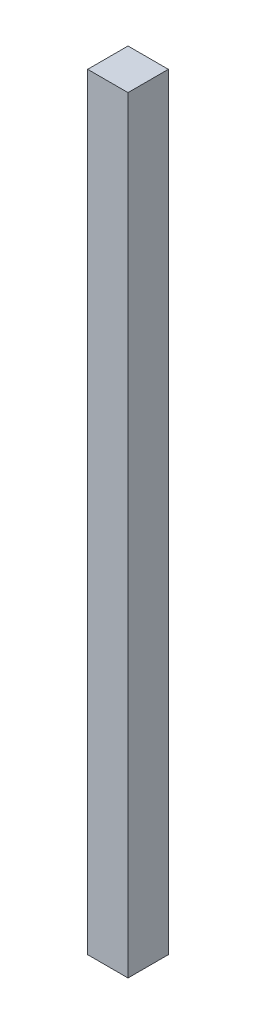
ISO-10303-21;
HEADER;
FILE_DESCRIPTION(('STEP AP214'),'2;1');
FILE_NAME('part.step','',(''),(''),'','','');
FILE_SCHEMA(('AUTOMOTIVE_DESIGN { 1 0 10303 214 1 1 1 1 }'));
ENDSEC;
DATA;
#1=APPLICATION_CONTEXT('core data for automotive mechanical design processes');
#2=APPLICATION_PROTOCOL_DEFINITION('international standard','automotive_design',2000,#1);
#3=PRODUCT_CONTEXT('',#1,'mechanical');
#4=PRODUCT('Part','Part','',(#3));
#5=PRODUCT_RELATED_PRODUCT_CATEGORY('part','',(#4));
#6=PRODUCT_DEFINITION_FORMATION('','',#4);
#7=PRODUCT_DEFINITION_CONTEXT('part definition',#1,'design');
#8=PRODUCT_DEFINITION('design','',#6,#7);
#9=PRODUCT_DEFINITION_SHAPE('','',#8);
#10=(LENGTH_UNIT() NAMED_UNIT(*) SI_UNIT(.MILLI.,.METRE.));
#11=(NAMED_UNIT(*) PLANE_ANGLE_UNIT() SI_UNIT($,.RADIAN.));
#12=(NAMED_UNIT(*) SI_UNIT($,.STERADIAN.) SOLID_ANGLE_UNIT());
#13=UNCERTAINTY_MEASURE_WITH_UNIT(LENGTH_MEASURE(1.E-05),#10,'distance_accuracy_value','');
#14=(GEOMETRIC_REPRESENTATION_CONTEXT(3) GLOBAL_UNCERTAINTY_ASSIGNED_CONTEXT((#13)) GLOBAL_UNIT_ASSIGNED_CONTEXT((#10,
#11,#12)) REPRESENTATION_CONTEXT('',''));
#15=CARTESIAN_POINT('',(0.,0.,0.));
#16=DIRECTION('',(0.,0.,1.));
#17=DIRECTION('',(1.,0.,0.));
#18=AXIS2_PLACEMENT_3D('',#15,#16,#17);
#19=CARTESIAN_POINT('',(-15.,313.5,-15.));
#20=DIRECTION('',(1.,0.,0.));
#21=DIRECTION('',(0.,0.,-1.));
#22=AXIS2_PLACEMENT_3D('',#19,#20,#21);
#23=PLANE('',#22);
#24=DIRECTION('',(0.,0.,1.));
#25=VECTOR('',#24,1.);
#26=CARTESIAN_POINT('',(-15.,-256.5,-15.));
#27=LINE('',#26,#25);
#28=CARTESIAN_POINT('',(-15.,-256.5,-15.));
#29=VERTEX_POINT('',#28);
#30=CARTESIAN_POINT('',(-15.,-256.5,15.));
#31=VERTEX_POINT('',#30);
#32=EDGE_CURVE('E107',#29,#31,#27,.T.);
#33=ORIENTED_EDGE('',*,*,#32,.T.);
#34=DIRECTION('',(0.,-1.,0.));
#35=VECTOR('',#34,1.);
#36=CARTESIAN_POINT('',(-15.,313.5,15.));
#37=LINE('',#36,#35);
#38=CARTESIAN_POINT('',(-15.,313.5,15.));
#39=VERTEX_POINT('',#38);
#40=EDGE_CURVE('E11',#39,#31,#37,.T.);
#41=ORIENTED_EDGE('',*,*,#40,.F.);
#42=DIRECTION('',(0.,0.,1.));
#43=VECTOR('',#42,1.);
#44=CARTESIAN_POINT('',(-15.,313.5,-15.));
#45=LINE('',#44,#43);
#46=CARTESIAN_POINT('',(-15.,313.5,-15.));
#47=VERTEX_POINT('',#46);
#48=EDGE_CURVE('E91',#47,#39,#45,.T.);
#49=ORIENTED_EDGE('',*,*,#48,.F.);
#50=DIRECTION('',(0.,-1.,0.));
#51=VECTOR('',#50,1.);
#52=CARTESIAN_POINT('',(-15.,313.5,-15.));
#53=LINE('',#52,#51);
#54=EDGE_CURVE('E103',#47,#29,#53,.T.);
#55=ORIENTED_EDGE('',*,*,#54,.T.);
#56=EDGE_LOOP('',(#33,#41,#49,#55));
#57=FACE_BOUND('',#56,.T.);
#58=ADVANCED_FACE('F39',(#57),#23,.F.);
#59=CARTESIAN_POINT('',(15.,313.5,15.));
#60=DIRECTION('',(0.,0.,-1.));
#61=DIRECTION('',(-1.,0.,0.));
#62=AXIS2_PLACEMENT_3D('',#59,#60,#61);
#63=PLANE('',#62);
#64=DIRECTION('',(1.,0.,0.));
#65=VECTOR('',#64,1.);
#66=CARTESIAN_POINT('',(15.,-256.5,15.));
#67=LINE('',#66,#65);
#68=CARTESIAN_POINT('',(15.,-256.5,15.));
#69=VERTEX_POINT('',#68);
#70=EDGE_CURVE('E96',#31,#69,#67,.T.);
#71=ORIENTED_EDGE('',*,*,#70,.T.);
#72=DIRECTION('',(0.,-1.,0.));
#73=VECTOR('',#72,1.);
#74=CARTESIAN_POINT('',(15.,313.5,15.));
#75=LINE('',#74,#73);
#76=CARTESIAN_POINT('',(15.,313.5,15.));
#77=VERTEX_POINT('',#76);
#78=EDGE_CURVE('E48',#77,#69,#75,.T.);
#79=ORIENTED_EDGE('',*,*,#78,.F.);
#80=DIRECTION('',(1.,0.,0.));
#81=VECTOR('',#80,1.);
#82=CARTESIAN_POINT('',(15.,313.5,15.));
#83=LINE('',#82,#81);
#84=EDGE_CURVE('E86',#39,#77,#83,.T.);
#85=ORIENTED_EDGE('',*,*,#84,.F.);
#86=ORIENTED_EDGE('',*,*,#40,.T.);
#87=EDGE_LOOP('',(#71,#79,#85,#86));
#88=FACE_BOUND('',#87,.T.);
#89=ADVANCED_FACE('F95',(#88),#63,.F.);
#90=CARTESIAN_POINT('',(15.,313.5,-15.));
#91=DIRECTION('',(-1.,0.,0.));
#92=DIRECTION('',(0.,0.,1.));
#93=AXIS2_PLACEMENT_3D('',#90,#91,#92);
#94=PLANE('',#93);
#95=DIRECTION('',(0.,0.,-1.));
#96=VECTOR('',#95,1.);
#97=CARTESIAN_POINT('',(15.,-256.5,-15.));
#98=LINE('',#97,#96);
#99=CARTESIAN_POINT('',(15.,-256.5,-15.));
#100=VERTEX_POINT('',#99);
#101=EDGE_CURVE('E73',#69,#100,#98,.T.);
#102=ORIENTED_EDGE('',*,*,#101,.T.);
#103=DIRECTION('',(0.,-1.,0.));
#104=VECTOR('',#103,1.);
#105=CARTESIAN_POINT('',(15.,313.5,-15.));
#106=LINE('',#105,#104);
#107=CARTESIAN_POINT('',(15.,313.5,-15.));
#108=VERTEX_POINT('',#107);
#109=EDGE_CURVE('E98',#108,#100,#106,.T.);
#110=ORIENTED_EDGE('',*,*,#109,.F.);
#111=DIRECTION('',(0.,0.,-1.));
#112=VECTOR('',#111,1.);
#113=CARTESIAN_POINT('',(15.,313.5,-15.));
#114=LINE('',#113,#112);
#115=EDGE_CURVE('E89',#77,#108,#114,.T.);
#116=ORIENTED_EDGE('',*,*,#115,.F.);
#117=ORIENTED_EDGE('',*,*,#78,.T.);
#118=EDGE_LOOP('',(#102,#110,#116,#117));
#119=FACE_BOUND('',#118,.T.);
#120=ADVANCED_FACE('F99',(#119),#94,.F.);
#121=CARTESIAN_POINT('',(15.,313.5,-15.));
#122=DIRECTION('',(0.,0.,1.));
#123=DIRECTION('',(1.,0.,0.));
#124=AXIS2_PLACEMENT_3D('',#121,#122,#123);
#125=PLANE('',#124);
#126=DIRECTION('',(-1.,0.,0.));
#127=VECTOR('',#126,1.);
#128=CARTESIAN_POINT('',(15.,-256.5,-15.));
#129=LINE('',#128,#127);
#130=EDGE_CURVE('E79',#100,#29,#129,.T.);
#131=ORIENTED_EDGE('',*,*,#130,.T.);
#132=ORIENTED_EDGE('',*,*,#54,.F.);
#133=DIRECTION('',(-1.,0.,0.));
#134=VECTOR('',#133,1.);
#135=CARTESIAN_POINT('',(15.,313.5,-15.));
#136=LINE('',#135,#134);
#137=EDGE_CURVE('E56',#108,#47,#136,.T.);
#138=ORIENTED_EDGE('',*,*,#137,.F.);
#139=ORIENTED_EDGE('',*,*,#109,.T.);
#140=EDGE_LOOP('',(#131,#132,#138,#139));
#141=FACE_BOUND('',#140,.T.);
#142=ADVANCED_FACE('F120',(#141),#125,.F.);
#143=CARTESIAN_POINT('',(0.,313.5,0.));
#144=DIRECTION('',(0.,-1.,0.));
#145=DIRECTION('',(0.,0.,-1.));
#146=AXIS2_PLACEMENT_3D('',#143,#144,#145);
#147=PLANE('',#146);
#148=ORIENTED_EDGE('',*,*,#48,.T.);
#149=ORIENTED_EDGE('',*,*,#84,.T.);
#150=ORIENTED_EDGE('',*,*,#115,.T.);
#151=ORIENTED_EDGE('',*,*,#137,.T.);
#152=EDGE_LOOP('',(#148,#149,#150,#151));
#153=FACE_BOUND('',#152,.T.);
#154=ADVANCED_FACE('F87',(#153),#147,.F.);
#155=CARTESIAN_POINT('',(0.,-256.5,0.));
#156=DIRECTION('',(0.,-1.,0.));
#157=DIRECTION('',(0.,0.,-1.));
#158=AXIS2_PLACEMENT_3D('',#155,#156,#157);
#159=PLANE('',#158);
#160=ORIENTED_EDGE('',*,*,#32,.F.);
#161=ORIENTED_EDGE('',*,*,#130,.F.);
#162=ORIENTED_EDGE('',*,*,#101,.F.);
#163=ORIENTED_EDGE('',*,*,#70,.F.);
#164=EDGE_LOOP('',(#160,#161,#162,#163));
#165=FACE_BOUND('',#164,.T.);
#166=ADVANCED_FACE('F123',(#165),#159,.T.);
#167=CLOSED_SHELL('',(#58,#89,#120,#142,#154,#166));
#168=MANIFOLD_SOLID_BREP('B2',#167);
#169=ADVANCED_BREP_SHAPE_REPRESENTATION('',(#18,#168),#14);
#170=SHAPE_DEFINITION_REPRESENTATION(#9,#169);
ENDSEC;
END-ISO-10303-21;
